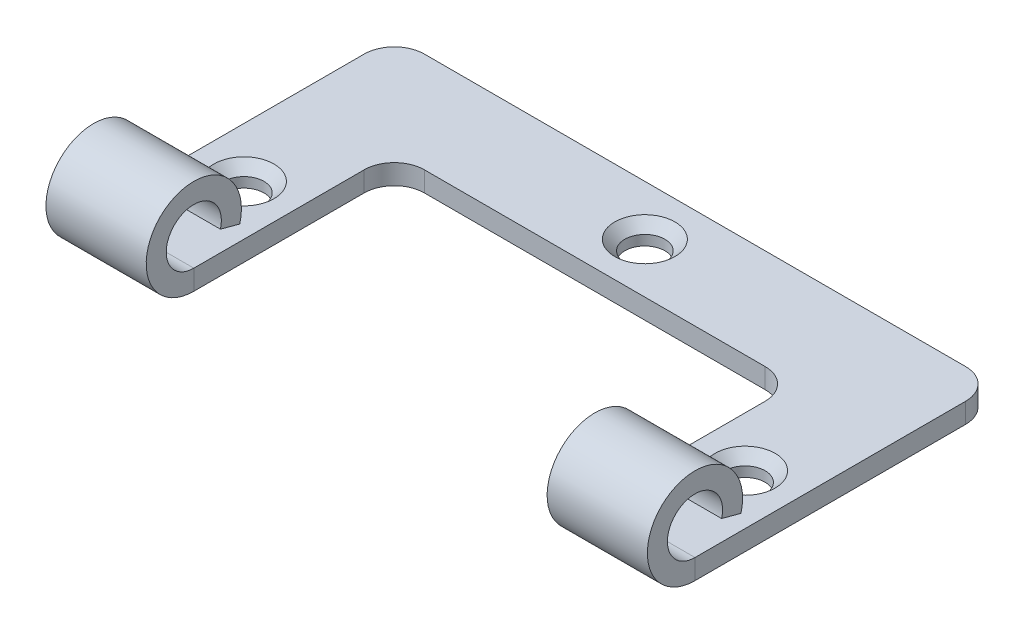
ISO-10303-21;
HEADER;
FILE_DESCRIPTION(('STEP AP214'),'2;1');
FILE_NAME('part.step','',(''),(''),'','','');
FILE_SCHEMA(('AUTOMOTIVE_DESIGN { 1 0 10303 214 1 1 1 1 }'));
ENDSEC;
DATA;
#1=APPLICATION_CONTEXT('core data for automotive mechanical design processes');
#2=APPLICATION_PROTOCOL_DEFINITION('international standard','automotive_design',2000,#1);
#3=PRODUCT_CONTEXT('',#1,'mechanical');
#4=PRODUCT('Part','Part','',(#3));
#5=PRODUCT_RELATED_PRODUCT_CATEGORY('part','',(#4));
#6=PRODUCT_DEFINITION_FORMATION('','',#4);
#7=PRODUCT_DEFINITION_CONTEXT('part definition',#1,'design');
#8=PRODUCT_DEFINITION('design','',#6,#7);
#9=PRODUCT_DEFINITION_SHAPE('','',#8);
#10=(LENGTH_UNIT() NAMED_UNIT(*) SI_UNIT(.MILLI.,.METRE.));
#11=(NAMED_UNIT(*) PLANE_ANGLE_UNIT() SI_UNIT($,.RADIAN.));
#12=(NAMED_UNIT(*) SI_UNIT($,.STERADIAN.) SOLID_ANGLE_UNIT());
#13=UNCERTAINTY_MEASURE_WITH_UNIT(LENGTH_MEASURE(1.E-05),#10,'distance_accuracy_value','');
#14=(GEOMETRIC_REPRESENTATION_CONTEXT(3) GLOBAL_UNCERTAINTY_ASSIGNED_CONTEXT((#13)) GLOBAL_UNIT_ASSIGNED_CONTEXT((#10,
#11,#12)) REPRESENTATION_CONTEXT('',''));
#15=CARTESIAN_POINT('',(0.,0.,0.));
#16=DIRECTION('',(0.,0.,1.));
#17=DIRECTION('',(1.,0.,0.));
#18=AXIS2_PLACEMENT_3D('',#15,#16,#17);
#19=CARTESIAN_POINT('',(-30.,-2.,15.));
#20=DIRECTION('',(-1.,0.,0.));
#21=DIRECTION('',(0.,0.,1.));
#22=AXIS2_PLACEMENT_3D('',#19,#20,#21);
#23=PLANE('',#22);
#24=DIRECTION('',(0.,0.,1.));
#25=VECTOR('',#24,1.);
#26=CARTESIAN_POINT('',(-30.,0.,15.));
#27=LINE('',#26,#25);
#28=CARTESIAN_POINT('',(-30.,0.,-12.));
#29=VERTEX_POINT('',#28);
#30=CARTESIAN_POINT('',(-30.,0.,15.));
#31=VERTEX_POINT('',#30);
#32=EDGE_CURVE('E165',#29,#31,#27,.T.);
#33=ORIENTED_EDGE('',*,*,#32,.F.);
#34=DIRECTION('',(0.,1.,0.));
#35=VECTOR('',#34,1.);
#36=CARTESIAN_POINT('',(-30.,-2.,-12.));
#37=LINE('',#36,#35);
#38=CARTESIAN_POINT('',(-30.,-2.,-12.));
#39=VERTEX_POINT('',#38);
#40=EDGE_CURVE('E61',#39,#29,#37,.T.);
#41=ORIENTED_EDGE('',*,*,#40,.F.);
#42=DIRECTION('',(0.,0.,1.));
#43=VECTOR('',#42,1.);
#44=CARTESIAN_POINT('',(-30.,-2.,15.));
#45=LINE('',#44,#43);
#46=CARTESIAN_POINT('',(-30.,-2.,15.));
#47=VERTEX_POINT('',#46);
#48=EDGE_CURVE('E199',#39,#47,#45,.T.);
#49=ORIENTED_EDGE('',*,*,#48,.T.);
#50=DIRECTION('',(0.,1.,0.));
#51=VECTOR('',#50,1.);
#52=CARTESIAN_POINT('',(-30.,-2.,15.));
#53=LINE('',#52,#51);
#54=EDGE_CURVE('E164',#47,#31,#53,.T.);
#55=ORIENTED_EDGE('',*,*,#54,.T.);
#56=EDGE_LOOP('',(#33,#41,#49,#55));
#57=FACE_BOUND('',#56,.T.);
#58=ADVANCED_FACE('F43',(#57),#23,.T.);
#59=CARTESIAN_POINT('',(-27.,-2.,-12.));
#60=DIRECTION('',(0.,1.,0.));
#61=DIRECTION('',(0.,0.,1.));
#62=AXIS2_PLACEMENT_3D('',#59,#60,#61);
#63=CYLINDRICAL_SURFACE('',#62,3.);
#64=CARTESIAN_POINT('',(-27.,0.,-12.));
#65=DIRECTION('',(0.,1.,0.));
#66=DIRECTION('',(0.,0.,-1.));
#67=AXIS2_PLACEMENT_3D('',#64,#65,#66);
#68=CIRCLE('',#67,3.);
#69=CARTESIAN_POINT('',(-27.,0.,-15.));
#70=VERTEX_POINT('',#69);
#71=EDGE_CURVE('E196',#70,#29,#68,.T.);
#72=ORIENTED_EDGE('',*,*,#71,.F.);
#73=DIRECTION('',(0.,1.,0.));
#74=VECTOR('',#73,1.);
#75=CARTESIAN_POINT('',(-27.,-2.,-15.));
#76=LINE('',#75,#74);
#77=CARTESIAN_POINT('',(-27.,-2.,-15.));
#78=VERTEX_POINT('',#77);
#79=EDGE_CURVE('E97',#78,#70,#76,.T.);
#80=ORIENTED_EDGE('',*,*,#79,.F.);
#81=CARTESIAN_POINT('',(-27.,-2.,-12.));
#82=DIRECTION('',(0.,1.,0.));
#83=DIRECTION('',(0.,0.,-1.));
#84=AXIS2_PLACEMENT_3D('',#81,#82,#83);
#85=CIRCLE('',#84,3.);
#86=EDGE_CURVE('E154',#78,#39,#85,.T.);
#87=ORIENTED_EDGE('',*,*,#86,.T.);
#88=ORIENTED_EDGE('',*,*,#40,.T.);
#89=EDGE_LOOP('',(#72,#80,#87,#88));
#90=FACE_BOUND('',#89,.T.);
#91=ADVANCED_FACE('F251',(#90),#63,.T.);
#92=CARTESIAN_POINT('',(-27.,-2.,-15.));
#93=DIRECTION('',(0.,0.,-1.));
#94=DIRECTION('',(-1.,0.,0.));
#95=AXIS2_PLACEMENT_3D('',#92,#93,#94);
#96=PLANE('',#95);
#97=DIRECTION('',(-1.,0.,0.));
#98=VECTOR('',#97,1.);
#99=CARTESIAN_POINT('',(-27.,0.,-15.));
#100=LINE('',#99,#98);
#101=CARTESIAN_POINT('',(27.,0.,-15.));
#102=VERTEX_POINT('',#101);
#103=EDGE_CURVE('E142',#102,#70,#100,.T.);
#104=ORIENTED_EDGE('',*,*,#103,.F.);
#105=DIRECTION('',(0.,1.,0.));
#106=VECTOR('',#105,1.);
#107=CARTESIAN_POINT('',(27.,-2.,-15.));
#108=LINE('',#107,#106);
#109=CARTESIAN_POINT('',(27.,-2.,-15.));
#110=VERTEX_POINT('',#109);
#111=EDGE_CURVE('E137',#110,#102,#108,.T.);
#112=ORIENTED_EDGE('',*,*,#111,.F.);
#113=DIRECTION('',(-1.,0.,0.));
#114=VECTOR('',#113,1.);
#115=CARTESIAN_POINT('',(-27.,-2.,-15.));
#116=LINE('',#115,#114);
#117=EDGE_CURVE('E140',#110,#78,#116,.T.);
#118=ORIENTED_EDGE('',*,*,#117,.T.);
#119=ORIENTED_EDGE('',*,*,#79,.T.);
#120=EDGE_LOOP('',(#104,#112,#118,#119));
#121=FACE_BOUND('',#120,.T.);
#122=ADVANCED_FACE('F139',(#121),#96,.T.);
#123=CARTESIAN_POINT('',(27.,-2.,-12.));
#124=DIRECTION('',(0.,1.,0.));
#125=DIRECTION('',(0.,0.,1.));
#126=AXIS2_PLACEMENT_3D('',#123,#124,#125);
#127=CYLINDRICAL_SURFACE('',#126,3.);
#128=CARTESIAN_POINT('',(27.,0.,-12.));
#129=DIRECTION('',(0.,1.,0.));
#130=DIRECTION('',(0.,0.,-1.));
#131=AXIS2_PLACEMENT_3D('',#128,#129,#130);
#132=CIRCLE('',#131,3.);
#133=CARTESIAN_POINT('',(30.,0.,-12.));
#134=VERTEX_POINT('',#133);
#135=EDGE_CURVE('E193',#134,#102,#132,.T.);
#136=ORIENTED_EDGE('',*,*,#135,.F.);
#137=DIRECTION('',(0.,1.,0.));
#138=VECTOR('',#137,1.);
#139=CARTESIAN_POINT('',(30.,-2.,-12.));
#140=LINE('',#139,#138);
#141=CARTESIAN_POINT('',(30.,-2.,-12.));
#142=VERTEX_POINT('',#141);
#143=EDGE_CURVE('E147',#142,#134,#140,.T.);
#144=ORIENTED_EDGE('',*,*,#143,.F.);
#145=CARTESIAN_POINT('',(27.,-2.,-12.));
#146=DIRECTION('',(0.,1.,0.));
#147=DIRECTION('',(0.,0.,-1.));
#148=AXIS2_PLACEMENT_3D('',#145,#146,#147);
#149=CIRCLE('',#148,3.);
#150=EDGE_CURVE('E152',#142,#110,#149,.T.);
#151=ORIENTED_EDGE('',*,*,#150,.T.);
#152=ORIENTED_EDGE('',*,*,#111,.T.);
#153=EDGE_LOOP('',(#136,#144,#151,#152));
#154=FACE_BOUND('',#153,.T.);
#155=ADVANCED_FACE('F156',(#154),#127,.T.);
#156=CARTESIAN_POINT('',(30.,-2.,15.));
#157=DIRECTION('',(1.,0.,0.));
#158=DIRECTION('',(0.,0.,-1.));
#159=AXIS2_PLACEMENT_3D('',#156,#157,#158);
#160=PLANE('',#159);
#161=DIRECTION('',(0.,0.,-1.));
#162=VECTOR('',#161,1.);
#163=CARTESIAN_POINT('',(30.,0.,15.));
#164=LINE('',#163,#162);
#165=CARTESIAN_POINT('',(30.,0.,15.));
#166=VERTEX_POINT('',#165);
#167=EDGE_CURVE('E190',#166,#134,#164,.T.);
#168=ORIENTED_EDGE('',*,*,#167,.F.);
#169=DIRECTION('',(0.,1.,0.));
#170=VECTOR('',#169,1.);
#171=CARTESIAN_POINT('',(30.,-2.,15.));
#172=LINE('',#171,#170);
#173=CARTESIAN_POINT('',(30.,-2.,15.));
#174=VERTEX_POINT('',#173);
#175=EDGE_CURVE('E204',#174,#166,#172,.T.);
#176=ORIENTED_EDGE('',*,*,#175,.F.);
#177=DIRECTION('',(0.,0.,-1.));
#178=VECTOR('',#177,1.);
#179=CARTESIAN_POINT('',(30.,-2.,15.));
#180=LINE('',#179,#178);
#181=EDGE_CURVE('E157',#174,#142,#180,.T.);
#182=ORIENTED_EDGE('',*,*,#181,.T.);
#183=ORIENTED_EDGE('',*,*,#143,.T.);
#184=EDGE_LOOP('',(#168,#176,#182,#183));
#185=FACE_BOUND('',#184,.T.);
#186=ADVANCED_FACE('F284',(#185),#160,.T.);
#187=CARTESIAN_POINT('',(20.,-2.,15.));
#188=DIRECTION('',(-1.,0.,0.));
#189=DIRECTION('',(0.,0.,1.));
#190=AXIS2_PLACEMENT_3D('',#187,#188,#189);
#191=PLANE('',#190);
#192=DIRECTION('',(0.,0.,1.));
#193=VECTOR('',#192,1.);
#194=CARTESIAN_POINT('',(20.,0.,15.));
#195=LINE('',#194,#193);
#196=CARTESIAN_POINT('',(20.,0.,-1.99999999999998));
#197=VERTEX_POINT('',#196);
#198=CARTESIAN_POINT('',(20.,0.,15.));
#199=VERTEX_POINT('',#198);
#200=EDGE_CURVE('E184',#197,#199,#195,.T.);
#201=ORIENTED_EDGE('',*,*,#200,.F.);
#202=DIRECTION('',(0.,1.,0.));
#203=VECTOR('',#202,1.);
#204=CARTESIAN_POINT('',(20.,-2.,-1.99999999999998));
#205=LINE('',#204,#203);
#206=CARTESIAN_POINT('',(20.,-2.,-1.99999999999998));
#207=VERTEX_POINT('',#206);
#208=EDGE_CURVE('E209',#207,#197,#205,.T.);
#209=ORIENTED_EDGE('',*,*,#208,.F.);
#210=DIRECTION('',(0.,0.,1.));
#211=VECTOR('',#210,1.);
#212=CARTESIAN_POINT('',(20.,-2.,15.));
#213=LINE('',#212,#211);
#214=CARTESIAN_POINT('',(20.,-2.,15.));
#215=VERTEX_POINT('',#214);
#216=EDGE_CURVE('E638',#207,#215,#213,.T.);
#217=ORIENTED_EDGE('',*,*,#216,.T.);
#218=DIRECTION('',(0.,1.,0.));
#219=VECTOR('',#218,1.);
#220=CARTESIAN_POINT('',(20.,-2.,15.));
#221=LINE('',#220,#219);
#222=EDGE_CURVE('E207',#215,#199,#221,.T.);
#223=ORIENTED_EDGE('',*,*,#222,.T.);
#224=EDGE_LOOP('',(#201,#209,#217,#223));
#225=FACE_BOUND('',#224,.T.);
#226=ADVANCED_FACE('F280',(#225),#191,.T.);
#227=CARTESIAN_POINT('',(17.,-2.,-2.));
#228=DIRECTION('',(0.,1.,0.));
#229=DIRECTION('',(0.,0.,1.));
#230=AXIS2_PLACEMENT_3D('',#227,#228,#229);
#231=CYLINDRICAL_SURFACE('',#230,3.);
#232=CARTESIAN_POINT('',(17.,0.,-2.));
#233=DIRECTION('',(0.,-1.,0.));
#234=DIRECTION('',(0.,0.,-1.));
#235=AXIS2_PLACEMENT_3D('',#232,#233,#234);
#236=CIRCLE('',#235,3.);
#237=CARTESIAN_POINT('',(17.,0.,-5.));
#238=VERTEX_POINT('',#237);
#239=EDGE_CURVE('E181',#238,#197,#236,.T.);
#240=ORIENTED_EDGE('',*,*,#239,.F.);
#241=DIRECTION('',(0.,1.,0.));
#242=VECTOR('',#241,1.);
#243=CARTESIAN_POINT('',(17.,-2.,-5.));
#244=LINE('',#243,#242);
#245=CARTESIAN_POINT('',(17.,-2.,-5.));
#246=VERTEX_POINT('',#245);
#247=EDGE_CURVE('E211',#246,#238,#244,.T.);
#248=ORIENTED_EDGE('',*,*,#247,.F.);
#249=CARTESIAN_POINT('',(17.,-2.,-2.));
#250=DIRECTION('',(0.,-1.,0.));
#251=DIRECTION('',(0.,0.,-1.));
#252=AXIS2_PLACEMENT_3D('',#249,#250,#251);
#253=CIRCLE('',#252,3.);
#254=EDGE_CURVE('E635',#246,#207,#253,.T.);
#255=ORIENTED_EDGE('',*,*,#254,.T.);
#256=ORIENTED_EDGE('',*,*,#208,.T.);
#257=EDGE_LOOP('',(#240,#248,#255,#256));
#258=FACE_BOUND('',#257,.T.);
#259=ADVANCED_FACE('F276',(#258),#231,.F.);
#260=CARTESIAN_POINT('',(-17.,-2.,-5.));
#261=DIRECTION('',(0.,0.,1.));
#262=DIRECTION('',(1.,0.,0.));
#263=AXIS2_PLACEMENT_3D('',#260,#261,#262);
#264=PLANE('',#263);
#265=DIRECTION('',(1.,0.,0.));
#266=VECTOR('',#265,1.);
#267=CARTESIAN_POINT('',(-17.,0.,-5.));
#268=LINE('',#267,#266);
#269=CARTESIAN_POINT('',(-17.,0.,-5.));
#270=VERTEX_POINT('',#269);
#271=EDGE_CURVE('E178',#270,#238,#268,.T.);
#272=ORIENTED_EDGE('',*,*,#271,.F.);
#273=DIRECTION('',(0.,1.,0.));
#274=VECTOR('',#273,1.);
#275=CARTESIAN_POINT('',(-17.,-2.,-5.));
#276=LINE('',#275,#274);
#277=CARTESIAN_POINT('',(-17.,-2.,-5.));
#278=VERTEX_POINT('',#277);
#279=EDGE_CURVE('E213',#278,#270,#276,.T.);
#280=ORIENTED_EDGE('',*,*,#279,.F.);
#281=DIRECTION('',(1.,0.,0.));
#282=VECTOR('',#281,1.);
#283=CARTESIAN_POINT('',(-17.,-2.,-5.));
#284=LINE('',#283,#282);
#285=EDGE_CURVE('E632',#278,#246,#284,.T.);
#286=ORIENTED_EDGE('',*,*,#285,.T.);
#287=ORIENTED_EDGE('',*,*,#247,.T.);
#288=EDGE_LOOP('',(#272,#280,#286,#287));
#289=FACE_BOUND('',#288,.T.);
#290=ADVANCED_FACE('F272',(#289),#264,.T.);
#291=CARTESIAN_POINT('',(-17.,-2.,-2.));
#292=DIRECTION('',(0.,1.,0.));
#293=DIRECTION('',(0.,0.,1.));
#294=AXIS2_PLACEMENT_3D('',#291,#292,#293);
#295=CYLINDRICAL_SURFACE('',#294,3.);
#296=CARTESIAN_POINT('',(-17.,0.,-2.));
#297=DIRECTION('',(0.,-1.,0.));
#298=DIRECTION('',(0.,0.,-1.));
#299=AXIS2_PLACEMENT_3D('',#296,#297,#298);
#300=CIRCLE('',#299,3.);
#301=CARTESIAN_POINT('',(-20.,0.,-1.99999999999998));
#302=VERTEX_POINT('',#301);
#303=EDGE_CURVE('E175',#302,#270,#300,.T.);
#304=ORIENTED_EDGE('',*,*,#303,.F.);
#305=DIRECTION('',(0.,1.,0.));
#306=VECTOR('',#305,1.);
#307=CARTESIAN_POINT('',(-20.,-2.,-1.99999999999998));
#308=LINE('',#307,#306);
#309=CARTESIAN_POINT('',(-20.,-2.,-1.99999999999998));
#310=VERTEX_POINT('',#309);
#311=EDGE_CURVE('E215',#310,#302,#308,.T.);
#312=ORIENTED_EDGE('',*,*,#311,.F.);
#313=CARTESIAN_POINT('',(-17.,-2.,-2.));
#314=DIRECTION('',(0.,-1.,0.));
#315=DIRECTION('',(0.,0.,-1.));
#316=AXIS2_PLACEMENT_3D('',#313,#314,#315);
#317=CIRCLE('',#316,3.);
#318=EDGE_CURVE('E629',#310,#278,#317,.T.);
#319=ORIENTED_EDGE('',*,*,#318,.T.);
#320=ORIENTED_EDGE('',*,*,#279,.T.);
#321=EDGE_LOOP('',(#304,#312,#319,#320));
#322=FACE_BOUND('',#321,.T.);
#323=ADVANCED_FACE('F268',(#322),#295,.F.);
#324=CARTESIAN_POINT('',(-20.,-2.,15.));
#325=DIRECTION('',(1.,0.,0.));
#326=DIRECTION('',(0.,0.,-1.));
#327=AXIS2_PLACEMENT_3D('',#324,#325,#326);
#328=PLANE('',#327);
#329=DIRECTION('',(0.,0.,-1.));
#330=VECTOR('',#329,1.);
#331=CARTESIAN_POINT('',(-20.,0.,15.));
#332=LINE('',#331,#330);
#333=CARTESIAN_POINT('',(-20.,0.,15.));
#334=VERTEX_POINT('',#333);
#335=EDGE_CURVE('E172',#334,#302,#332,.T.);
#336=ORIENTED_EDGE('',*,*,#335,.F.);
#337=DIRECTION('',(0.,1.,0.));
#338=VECTOR('',#337,1.);
#339=CARTESIAN_POINT('',(-20.,-2.,15.));
#340=LINE('',#339,#338);
#341=CARTESIAN_POINT('',(-20.,-2.,15.));
#342=VERTEX_POINT('',#341);
#343=EDGE_CURVE('E217',#342,#334,#340,.T.);
#344=ORIENTED_EDGE('',*,*,#343,.F.);
#345=DIRECTION('',(0.,0.,-1.));
#346=VECTOR('',#345,1.);
#347=CARTESIAN_POINT('',(-20.,-2.,15.));
#348=LINE('',#347,#346);
#349=EDGE_CURVE('E626',#342,#310,#348,.T.);
#350=ORIENTED_EDGE('',*,*,#349,.T.);
#351=ORIENTED_EDGE('',*,*,#311,.T.);
#352=EDGE_LOOP('',(#336,#344,#350,#351));
#353=FACE_BOUND('',#352,.T.);
#354=ADVANCED_FACE('F258',(#353),#328,.T.);
#355=CARTESIAN_POINT('',(-27.,-2.,-12.));
#356=DIRECTION('',(0.,-1.,0.));
#357=DIRECTION('',(0.,0.,-1.));
#358=AXIS2_PLACEMENT_3D('',#355,#356,#357);
#359=PLANE('',#358);
#360=CARTESIAN_POINT('',(0.,-2.,-10.));
#361=DIRECTION('',(0.,1.,0.));
#362=DIRECTION('',(0.,0.,1.));
#363=AXIS2_PLACEMENT_3D('',#360,#361,#362);
#364=CIRCLE('',#363,2.);
#365=CARTESIAN_POINT('',(0.,-2.,-8.));
#366=VERTEX_POINT('',#365);
#367=EDGE_CURVE('E569',#366,#366,#364,.T.);
#368=ORIENTED_EDGE('',*,*,#367,.T.);
#369=EDGE_LOOP('',(#368));
#370=FACE_BOUND('',#369,.T.);
#371=CARTESIAN_POINT('',(-25.,-2.,5.));
#372=DIRECTION('',(0.,1.,0.));
#373=DIRECTION('',(0.,0.,1.));
#374=AXIS2_PLACEMENT_3D('',#371,#372,#373);
#375=CIRCLE('',#374,2.);
#376=CARTESIAN_POINT('',(-25.,-2.,7.));
#377=VERTEX_POINT('',#376);
#378=EDGE_CURVE('E567',#377,#377,#375,.T.);
#379=ORIENTED_EDGE('',*,*,#378,.T.);
#380=EDGE_LOOP('',(#379));
#381=FACE_BOUND('',#380,.T.);
#382=CARTESIAN_POINT('',(25.,-2.,5.));
#383=DIRECTION('',(0.,1.,0.));
#384=DIRECTION('',(0.,0.,1.));
#385=AXIS2_PLACEMENT_3D('',#382,#383,#384);
#386=CIRCLE('',#385,2.);
#387=CARTESIAN_POINT('',(25.,-2.,7.));
#388=VERTEX_POINT('',#387);
#389=EDGE_CURVE('E570',#388,#388,#386,.T.);
#390=ORIENTED_EDGE('',*,*,#389,.T.);
#391=EDGE_LOOP('',(#390));
#392=FACE_BOUND('',#391,.T.);
#393=ORIENTED_EDGE('',*,*,#48,.F.);
#394=ORIENTED_EDGE('',*,*,#86,.F.);
#395=ORIENTED_EDGE('',*,*,#117,.F.);
#396=ORIENTED_EDGE('',*,*,#150,.F.);
#397=ORIENTED_EDGE('',*,*,#181,.F.);
#398=DIRECTION('',(1.,0.,0.));
#399=VECTOR('',#398,1.);
#400=CARTESIAN_POINT('',(20.,-2.,15.));
#401=LINE('',#400,#399);
#402=EDGE_CURVE('E159',#215,#174,#401,.T.);
#403=ORIENTED_EDGE('',*,*,#402,.F.);
#404=ORIENTED_EDGE('',*,*,#216,.F.);
#405=ORIENTED_EDGE('',*,*,#254,.F.);
#406=ORIENTED_EDGE('',*,*,#285,.F.);
#407=ORIENTED_EDGE('',*,*,#318,.F.);
#408=ORIENTED_EDGE('',*,*,#349,.F.);
#409=DIRECTION('',(1.,0.,0.));
#410=VECTOR('',#409,1.);
#411=CARTESIAN_POINT('',(-30.,-2.,15.));
#412=LINE('',#411,#410);
#413=EDGE_CURVE('E109',#47,#342,#412,.T.);
#414=ORIENTED_EDGE('',*,*,#413,.F.);
#415=EDGE_LOOP('',(#393,#394,#395,#396,#397,#403,#404,#405,#406,#407,#408,#414));
#416=FACE_BOUND('',#415,.T.);
#417=ADVANCED_FACE('F150',(#370,#381,#392,#416),#359,.T.);
#418=CARTESIAN_POINT('',(-27.,0.,-12.));
#419=DIRECTION('',(0.,-1.,0.));
#420=DIRECTION('',(0.,0.,-1.));
#421=AXIS2_PLACEMENT_3D('',#418,#419,#420);
#422=PLANE('',#421);
#423=CARTESIAN_POINT('',(25.,0.,5.));
#424=DIRECTION('',(0.,-1.,0.));
#425=DIRECTION('',(0.,0.,-1.));
#426=AXIS2_PLACEMENT_3D('',#423,#424,#425);
#427=CIRCLE('',#426,3.);
#428=CARTESIAN_POINT('',(25.,0.,2.));
#429=VERTEX_POINT('',#428);
#430=EDGE_CURVE('E229',#429,#429,#427,.T.);
#431=ORIENTED_EDGE('',*,*,#430,.T.);
#432=EDGE_LOOP('',(#431));
#433=FACE_BOUND('',#432,.T.);
#434=CARTESIAN_POINT('',(0.,0.,-10.));
#435=DIRECTION('',(0.,-1.,0.));
#436=DIRECTION('',(0.,0.,-1.));
#437=AXIS2_PLACEMENT_3D('',#434,#435,#436);
#438=CIRCLE('',#437,3.);
#439=CARTESIAN_POINT('',(0.,0.,-13.));
#440=VERTEX_POINT('',#439);
#441=EDGE_CURVE('E226',#440,#440,#438,.T.);
#442=ORIENTED_EDGE('',*,*,#441,.T.);
#443=EDGE_LOOP('',(#442));
#444=FACE_BOUND('',#443,.T.);
#445=CARTESIAN_POINT('',(-25.,0.,5.));
#446=DIRECTION('',(0.,-1.,0.));
#447=DIRECTION('',(0.,0.,-1.));
#448=AXIS2_PLACEMENT_3D('',#445,#446,#447);
#449=CIRCLE('',#448,3.);
#450=CARTESIAN_POINT('',(-25.,0.,2.));
#451=VERTEX_POINT('',#450);
#452=EDGE_CURVE('E223',#451,#451,#449,.T.);
#453=ORIENTED_EDGE('',*,*,#452,.T.);
#454=EDGE_LOOP('',(#453));
#455=FACE_BOUND('',#454,.T.);
#456=ORIENTED_EDGE('',*,*,#32,.T.);
#457=DIRECTION('',(1.,0.,0.));
#458=VECTOR('',#457,1.);
#459=CARTESIAN_POINT('',(-30.,0.,15.));
#460=LINE('',#459,#458);
#461=EDGE_CURVE('E168',#31,#334,#460,.T.);
#462=ORIENTED_EDGE('',*,*,#461,.T.);
#463=ORIENTED_EDGE('',*,*,#335,.T.);
#464=ORIENTED_EDGE('',*,*,#303,.T.);
#465=ORIENTED_EDGE('',*,*,#271,.T.);
#466=ORIENTED_EDGE('',*,*,#239,.T.);
#467=ORIENTED_EDGE('',*,*,#200,.T.);
#468=DIRECTION('',(1.,0.,0.));
#469=VECTOR('',#468,1.);
#470=CARTESIAN_POINT('',(20.,0.,15.));
#471=LINE('',#470,#469);
#472=EDGE_CURVE('E187',#199,#166,#471,.T.);
#473=ORIENTED_EDGE('',*,*,#472,.T.);
#474=ORIENTED_EDGE('',*,*,#167,.T.);
#475=ORIENTED_EDGE('',*,*,#135,.T.);
#476=ORIENTED_EDGE('',*,*,#103,.T.);
#477=ORIENTED_EDGE('',*,*,#71,.T.);
#478=EDGE_LOOP('',(#456,#462,#463,#464,#465,#466,#467,#473,#474,#475,#476,#477));
#479=FACE_BOUND('',#478,.T.);
#480=ADVANCED_FACE('F293',(#433,#444,#455,#479),#422,.F.);
#481=CARTESIAN_POINT('',(-25.,2.03824762596804,12.3437039777051));
#482=DIRECTION('',(0.,0.965925826289066,-0.258819045102531));
#483=DIRECTION('',(1.,0.,0.));
#484=AXIS2_PLACEMENT_3D('',#481,#482,#483);
#485=PLANE('',#484);
#486=DIRECTION('',(0.,-0.258819045102531,-0.965925826289066));
#487=VECTOR('',#486,1.);
#488=CARTESIAN_POINT('',(-20.,2.03824762596804,12.3437039777051));
#489=LINE('',#488,#487);
#490=CARTESIAN_POINT('',(-20.,2.03824762596804,12.3437039777051));
#491=VERTEX_POINT('',#490);
#492=CARTESIAN_POINT('',(-20.,1.52060953576298,10.4118523251269));
#493=VERTEX_POINT('',#492);
#494=EDGE_CURVE('E169',#491,#493,#489,.T.);
#495=ORIENTED_EDGE('',*,*,#494,.F.);
#496=DIRECTION('',(1.,0.,0.));
#497=VECTOR('',#496,1.);
#498=CARTESIAN_POINT('',(-20.,2.03824762596804,12.3437039777051));
#499=LINE('',#498,#497);
#500=CARTESIAN_POINT('',(-30.,2.03824762596804,12.3437039777051));
#501=VERTEX_POINT('',#500);
#502=EDGE_CURVE('E601',#501,#491,#499,.T.);
#503=ORIENTED_EDGE('',*,*,#502,.F.);
#504=DIRECTION('',(0.,-0.258819045102531,-0.965925826289066));
#505=VECTOR('',#504,1.);
#506=CARTESIAN_POINT('',(-30.,2.03824762596804,12.3437039777051));
#507=LINE('',#506,#505);
#508=CARTESIAN_POINT('',(-30.,1.52060953576298,10.4118523251269));
#509=VERTEX_POINT('',#508);
#510=EDGE_CURVE('E605',#501,#509,#507,.T.);
#511=ORIENTED_EDGE('',*,*,#510,.T.);
#512=DIRECTION('',(1.,0.,0.));
#513=VECTOR('',#512,1.);
#514=CARTESIAN_POINT('',(-20.,1.52060953576298,10.4118523251269));
#515=LINE('',#514,#513);
#516=EDGE_CURVE('E607',#509,#493,#515,.T.);
#517=ORIENTED_EDGE('',*,*,#516,.T.);
#518=EDGE_LOOP('',(#495,#503,#511,#517));
#519=FACE_BOUND('',#518,.T.);
#520=ADVANCED_FACE('F296',(#519),#485,.F.);
#521=CARTESIAN_POINT('',(-30.,2.75,15.));
#522=DIRECTION('',(-1.,0.,0.));
#523=DIRECTION('',(0.,-1.,0.));
#524=AXIS2_PLACEMENT_3D('',#521,#522,#523);
#525=PLANE('',#524);
#526=ORIENTED_EDGE('',*,*,#510,.F.);
#527=CARTESIAN_POINT('',(-30.,2.75,15.));
#528=DIRECTION('',(1.,0.,0.));
#529=DIRECTION('',(0.,1.,0.));
#530=AXIS2_PLACEMENT_3D('',#527,#528,#529);
#531=CIRCLE('',#530,2.75);
#532=EDGE_CURVE('E610',#31,#501,#531,.F.);
#533=ORIENTED_EDGE('',*,*,#532,.F.);
#534=ORIENTED_EDGE('',*,*,#54,.F.);
#535=CARTESIAN_POINT('',(-30.,2.75,15.));
#536=DIRECTION('',(1.,0.,0.));
#537=DIRECTION('',(0.,1.,0.));
#538=AXIS2_PLACEMENT_3D('',#535,#536,#537);
#539=CIRCLE('',#538,4.75);
#540=EDGE_CURVE('E602',#47,#509,#539,.F.);
#541=ORIENTED_EDGE('',*,*,#540,.T.);
#542=EDGE_LOOP('',(#526,#533,#534,#541));
#543=FACE_BOUND('',#542,.T.);
#544=ADVANCED_FACE('F305',(#543),#525,.T.);
#545=CARTESIAN_POINT('',(-20.,2.75,15.));
#546=DIRECTION('',(-1.,0.,0.));
#547=DIRECTION('',(0.,-1.,0.));
#548=AXIS2_PLACEMENT_3D('',#545,#546,#547);
#549=PLANE('',#548);
#550=CARTESIAN_POINT('',(-20.,2.75,15.));
#551=DIRECTION('',(1.,0.,0.));
#552=DIRECTION('',(0.,1.,0.));
#553=AXIS2_PLACEMENT_3D('',#550,#551,#552);
#554=CIRCLE('',#553,2.75);
#555=EDGE_CURVE('E615',#491,#334,#554,.T.);
#556=ORIENTED_EDGE('',*,*,#555,.F.);
#557=ORIENTED_EDGE('',*,*,#494,.T.);
#558=CARTESIAN_POINT('',(-20.,2.75,15.));
#559=DIRECTION('',(1.,0.,0.));
#560=DIRECTION('',(0.,1.,0.));
#561=AXIS2_PLACEMENT_3D('',#558,#559,#560);
#562=CIRCLE('',#561,4.75);
#563=EDGE_CURVE('E606',#493,#342,#562,.T.);
#564=ORIENTED_EDGE('',*,*,#563,.T.);
#565=ORIENTED_EDGE('',*,*,#343,.T.);
#566=EDGE_LOOP('',(#556,#557,#564,#565));
#567=FACE_BOUND('',#566,.T.);
#568=ADVANCED_FACE('F301',(#567),#549,.F.);
#569=CARTESIAN_POINT('',(-20.,2.75,15.));
#570=DIRECTION('',(1.,0.,0.));
#571=DIRECTION('',(0.,-0.258819045102531,-0.965925826289066));
#572=AXIS2_PLACEMENT_3D('',#569,#570,#571);
#573=CYLINDRICAL_SURFACE('',#572,4.75);
#574=ORIENTED_EDGE('',*,*,#413,.T.);
#575=ORIENTED_EDGE('',*,*,#563,.F.);
#576=ORIENTED_EDGE('',*,*,#516,.F.);
#577=ORIENTED_EDGE('',*,*,#540,.F.);
#578=EDGE_LOOP('',(#574,#575,#576,#577));
#579=FACE_BOUND('',#578,.T.);
#580=ADVANCED_FACE('F304',(#579),#573,.T.);
#581=CARTESIAN_POINT('',(-20.,2.75,15.));
#582=DIRECTION('',(1.,0.,0.));
#583=DIRECTION('',(0.,-0.258819045102531,-0.965925826289066));
#584=AXIS2_PLACEMENT_3D('',#581,#582,#583);
#585=CYLINDRICAL_SURFACE('',#584,2.75);
#586=ORIENTED_EDGE('',*,*,#461,.F.);
#587=ORIENTED_EDGE('',*,*,#532,.T.);
#588=ORIENTED_EDGE('',*,*,#502,.T.);
#589=ORIENTED_EDGE('',*,*,#555,.T.);
#590=EDGE_LOOP('',(#586,#587,#588,#589));
#591=FACE_BOUND('',#590,.T.);
#592=ADVANCED_FACE('F313',(#591),#585,.F.);
#593=CARTESIAN_POINT('',(25.,2.03824762596804,12.3437039777051));
#594=DIRECTION('',(0.,0.965925826289066,-0.258819045102531));
#595=DIRECTION('',(1.,0.,0.));
#596=AXIS2_PLACEMENT_3D('',#593,#594,#595);
#597=PLANE('',#596);
#598=DIRECTION('',(0.,-0.258819045102531,-0.965925826289066));
#599=VECTOR('',#598,1.);
#600=CARTESIAN_POINT('',(30.,2.03824762596804,12.3437039777051));
#601=LINE('',#600,#599);
#602=CARTESIAN_POINT('',(30.,2.03824762596804,12.3437039777051));
#603=VERTEX_POINT('',#602);
#604=CARTESIAN_POINT('',(30.,1.52060953576298,10.4118523251269));
#605=VERTEX_POINT('',#604);
#606=EDGE_CURVE('E598',#603,#605,#601,.T.);
#607=ORIENTED_EDGE('',*,*,#606,.F.);
#608=DIRECTION('',(1.,0.,0.));
#609=VECTOR('',#608,1.);
#610=CARTESIAN_POINT('',(30.,2.03824762596804,12.3437039777051));
#611=LINE('',#610,#609);
#612=CARTESIAN_POINT('',(20.,2.03824762596804,12.3437039777051));
#613=VERTEX_POINT('',#612);
#614=EDGE_CURVE('E573',#613,#603,#611,.T.);
#615=ORIENTED_EDGE('',*,*,#614,.F.);
#616=DIRECTION('',(0.,-0.258819045102531,-0.965925826289066));
#617=VECTOR('',#616,1.);
#618=CARTESIAN_POINT('',(20.,2.03824762596804,12.3437039777051));
#619=LINE('',#618,#617);
#620=CARTESIAN_POINT('',(20.,1.52060953576298,10.4118523251269));
#621=VERTEX_POINT('',#620);
#622=EDGE_CURVE('E581',#613,#621,#619,.T.);
#623=ORIENTED_EDGE('',*,*,#622,.T.);
#624=DIRECTION('',(1.,0.,0.));
#625=VECTOR('',#624,1.);
#626=CARTESIAN_POINT('',(30.,1.52060953576298,10.4118523251269));
#627=LINE('',#626,#625);
#628=EDGE_CURVE('E583',#621,#605,#627,.T.);
#629=ORIENTED_EDGE('',*,*,#628,.T.);
#630=EDGE_LOOP('',(#607,#615,#623,#629));
#631=FACE_BOUND('',#630,.T.);
#632=ADVANCED_FACE('F316',(#631),#597,.F.);
#633=CARTESIAN_POINT('',(20.,2.75,15.));
#634=DIRECTION('',(-1.,0.,0.));
#635=DIRECTION('',(0.,-1.,0.));
#636=AXIS2_PLACEMENT_3D('',#633,#634,#635);
#637=PLANE('',#636);
#638=ORIENTED_EDGE('',*,*,#622,.F.);
#639=CARTESIAN_POINT('',(20.,2.75,15.));
#640=DIRECTION('',(1.,0.,0.));
#641=DIRECTION('',(0.,1.,0.));
#642=AXIS2_PLACEMENT_3D('',#639,#640,#641);
#643=CIRCLE('',#642,2.75);
#644=EDGE_CURVE('E586',#199,#613,#643,.F.);
#645=ORIENTED_EDGE('',*,*,#644,.F.);
#646=ORIENTED_EDGE('',*,*,#222,.F.);
#647=CARTESIAN_POINT('',(20.,2.75,15.));
#648=DIRECTION('',(1.,0.,0.));
#649=DIRECTION('',(0.,1.,0.));
#650=AXIS2_PLACEMENT_3D('',#647,#648,#649);
#651=CIRCLE('',#650,4.75);
#652=EDGE_CURVE('E578',#215,#621,#651,.F.);
#653=ORIENTED_EDGE('',*,*,#652,.T.);
#654=EDGE_LOOP('',(#638,#645,#646,#653));
#655=FACE_BOUND('',#654,.T.);
#656=ADVANCED_FACE('F325',(#655),#637,.T.);
#657=CARTESIAN_POINT('',(30.,2.75,15.));
#658=DIRECTION('',(-1.,0.,0.));
#659=DIRECTION('',(0.,-1.,0.));
#660=AXIS2_PLACEMENT_3D('',#657,#658,#659);
#661=PLANE('',#660);
#662=CARTESIAN_POINT('',(30.,2.75,15.));
#663=DIRECTION('',(1.,0.,0.));
#664=DIRECTION('',(0.,1.,0.));
#665=AXIS2_PLACEMENT_3D('',#662,#663,#664);
#666=CIRCLE('',#665,2.75);
#667=EDGE_CURVE('E591',#603,#166,#666,.T.);
#668=ORIENTED_EDGE('',*,*,#667,.F.);
#669=ORIENTED_EDGE('',*,*,#606,.T.);
#670=CARTESIAN_POINT('',(30.,2.75,15.));
#671=DIRECTION('',(1.,0.,0.));
#672=DIRECTION('',(0.,1.,0.));
#673=AXIS2_PLACEMENT_3D('',#670,#671,#672);
#674=CIRCLE('',#673,4.75);
#675=EDGE_CURVE('E582',#605,#174,#674,.T.);
#676=ORIENTED_EDGE('',*,*,#675,.T.);
#677=ORIENTED_EDGE('',*,*,#175,.T.);
#678=EDGE_LOOP('',(#668,#669,#676,#677));
#679=FACE_BOUND('',#678,.T.);
#680=ADVANCED_FACE('F321',(#679),#661,.F.);
#681=CARTESIAN_POINT('',(30.,2.75,15.));
#682=DIRECTION('',(1.,0.,0.));
#683=DIRECTION('',(0.,-0.258819045102531,-0.965925826289066));
#684=AXIS2_PLACEMENT_3D('',#681,#682,#683);
#685=CYLINDRICAL_SURFACE('',#684,4.75);
#686=ORIENTED_EDGE('',*,*,#402,.T.);
#687=ORIENTED_EDGE('',*,*,#675,.F.);
#688=ORIENTED_EDGE('',*,*,#628,.F.);
#689=ORIENTED_EDGE('',*,*,#652,.F.);
#690=EDGE_LOOP('',(#686,#687,#688,#689));
#691=FACE_BOUND('',#690,.T.);
#692=ADVANCED_FACE('F324',(#691),#685,.T.);
#693=CARTESIAN_POINT('',(30.,2.75,15.));
#694=DIRECTION('',(1.,0.,0.));
#695=DIRECTION('',(0.,-0.258819045102531,-0.965925826289066));
#696=AXIS2_PLACEMENT_3D('',#693,#694,#695);
#697=CYLINDRICAL_SURFACE('',#696,2.75);
#698=ORIENTED_EDGE('',*,*,#472,.F.);
#699=ORIENTED_EDGE('',*,*,#644,.T.);
#700=ORIENTED_EDGE('',*,*,#614,.T.);
#701=ORIENTED_EDGE('',*,*,#667,.T.);
#702=EDGE_LOOP('',(#698,#699,#700,#701));
#703=FACE_BOUND('',#702,.T.);
#704=ADVANCED_FACE('F333',(#703),#697,.F.);
#705=CARTESIAN_POINT('',(25.,-2.,5.));
#706=DIRECTION('',(0.,1.,0.));
#707=DIRECTION('',(0.,0.,1.));
#708=AXIS2_PLACEMENT_3D('',#705,#706,#707);
#709=CYLINDRICAL_SURFACE('',#708,2.);
#710=CARTESIAN_POINT('',(25.,-0.999999999999989,5.));
#711=DIRECTION('',(0.,-1.,0.));
#712=DIRECTION('',(0.,0.,-1.));
#713=AXIS2_PLACEMENT_3D('',#710,#711,#712);
#714=CIRCLE('',#713,2.);
#715=CARTESIAN_POINT('',(25.,-0.999999999999989,3.));
#716=VERTEX_POINT('',#715);
#717=EDGE_CURVE('E201',#716,#716,#714,.F.);
#718=ORIENTED_EDGE('',*,*,#717,.T.);
#719=EDGE_LOOP('',(#718));
#720=FACE_BOUND('',#719,.T.);
#721=ORIENTED_EDGE('',*,*,#389,.F.);
#722=EDGE_LOOP('',(#721));
#723=FACE_BOUND('',#722,.T.);
#724=ADVANCED_FACE('F336',(#720,#723),#709,.F.);
#725=CARTESIAN_POINT('',(-25.,-2.,5.));
#726=DIRECTION('',(0.,1.,0.));
#727=DIRECTION('',(0.,0.,1.));
#728=AXIS2_PLACEMENT_3D('',#725,#726,#727);
#729=CYLINDRICAL_SURFACE('',#728,2.);
#730=CARTESIAN_POINT('',(-25.,-0.999999999999986,5.));
#731=DIRECTION('',(0.,-1.,0.));
#732=DIRECTION('',(0.,0.,-1.));
#733=AXIS2_PLACEMENT_3D('',#730,#731,#732);
#734=CIRCLE('',#733,2.);
#735=CARTESIAN_POINT('',(-25.,-0.999999999999986,2.99999999999999));
#736=VERTEX_POINT('',#735);
#737=EDGE_CURVE('E11',#736,#736,#734,.F.);
#738=ORIENTED_EDGE('',*,*,#737,.T.);
#739=EDGE_LOOP('',(#738));
#740=FACE_BOUND('',#739,.T.);
#741=ORIENTED_EDGE('',*,*,#378,.F.);
#742=EDGE_LOOP('',(#741));
#743=FACE_BOUND('',#742,.T.);
#744=ADVANCED_FACE('F343',(#740,#743),#729,.F.);
#745=CARTESIAN_POINT('',(0.,-2.,-10.));
#746=DIRECTION('',(0.,1.,0.));
#747=DIRECTION('',(0.,0.,1.));
#748=AXIS2_PLACEMENT_3D('',#745,#746,#747);
#749=CYLINDRICAL_SURFACE('',#748,2.);
#750=CARTESIAN_POINT('',(0.,-0.999999999999989,-10.));
#751=DIRECTION('',(0.,-1.,0.));
#752=DIRECTION('',(0.,0.,-1.));
#753=AXIS2_PLACEMENT_3D('',#750,#751,#752);
#754=CIRCLE('',#753,2.);
#755=CARTESIAN_POINT('',(0.,-0.999999999999989,-12.));
#756=VERTEX_POINT('',#755);
#757=EDGE_CURVE('E53',#756,#756,#754,.F.);
#758=ORIENTED_EDGE('',*,*,#757,.T.);
#759=EDGE_LOOP('',(#758));
#760=FACE_BOUND('',#759,.T.);
#761=ORIENTED_EDGE('',*,*,#367,.F.);
#762=EDGE_LOOP('',(#761));
#763=FACE_BOUND('',#762,.T.);
#764=ADVANCED_FACE('F234',(#760,#763),#749,.F.);
#765=CARTESIAN_POINT('',(25.,-0.999999999999989,5.));
#766=DIRECTION('',(0.,1.,0.));
#767=DIRECTION('',(0.,0.,1.));
#768=AXIS2_PLACEMENT_3D('',#765,#766,#767);
#769=CONICAL_SURFACE('',#768,2.,0.785398163397452);
#770=ORIENTED_EDGE('',*,*,#430,.F.);
#771=EDGE_LOOP('',(#770));
#772=FACE_BOUND('',#771,.T.);
#773=ORIENTED_EDGE('',*,*,#717,.F.);
#774=EDGE_LOOP('',(#773));
#775=FACE_BOUND('',#774,.T.);
#776=ADVANCED_FACE('F239',(#772,#775),#769,.F.);
#777=CARTESIAN_POINT('',(0.,-0.999999999999989,-10.));
#778=DIRECTION('',(0.,1.,0.));
#779=DIRECTION('',(0.,0.,1.));
#780=AXIS2_PLACEMENT_3D('',#777,#778,#779);
#781=CONICAL_SURFACE('',#780,2.,0.785398163397452);
#782=ORIENTED_EDGE('',*,*,#441,.F.);
#783=EDGE_LOOP('',(#782));
#784=FACE_BOUND('',#783,.T.);
#785=ORIENTED_EDGE('',*,*,#757,.F.);
#786=EDGE_LOOP('',(#785));
#787=FACE_BOUND('',#786,.T.);
#788=ADVANCED_FACE('F237',(#784,#787),#781,.F.);
#789=CARTESIAN_POINT('',(-25.,-0.999999999999986,5.));
#790=DIRECTION('',(0.,1.,0.));
#791=DIRECTION('',(0.,0.,1.));
#792=AXIS2_PLACEMENT_3D('',#789,#790,#791);
#793=CONICAL_SURFACE('',#792,2.,0.785398163397452);
#794=ORIENTED_EDGE('',*,*,#452,.F.);
#795=EDGE_LOOP('',(#794));
#796=FACE_BOUND('',#795,.T.);
#797=ORIENTED_EDGE('',*,*,#737,.F.);
#798=EDGE_LOOP('',(#797));
#799=FACE_BOUND('',#798,.T.);
#800=ADVANCED_FACE('F46',(#796,#799),#793,.F.);
#801=CLOSED_SHELL('',(#58,#91,#122,#155,#186,#226,#259,#290,#323,#354,#417,#480,#520,#544,#568,
#580,#592,#632,#656,#680,#692,#704,#724,#744,#764,#776,#788,#800));
#802=MANIFOLD_SOLID_BREP('B2',#801);
#803=ADVANCED_BREP_SHAPE_REPRESENTATION('',(#18,#802),#14);
#804=SHAPE_DEFINITION_REPRESENTATION(#9,#803);
ENDSEC;
END-ISO-10303-21;
